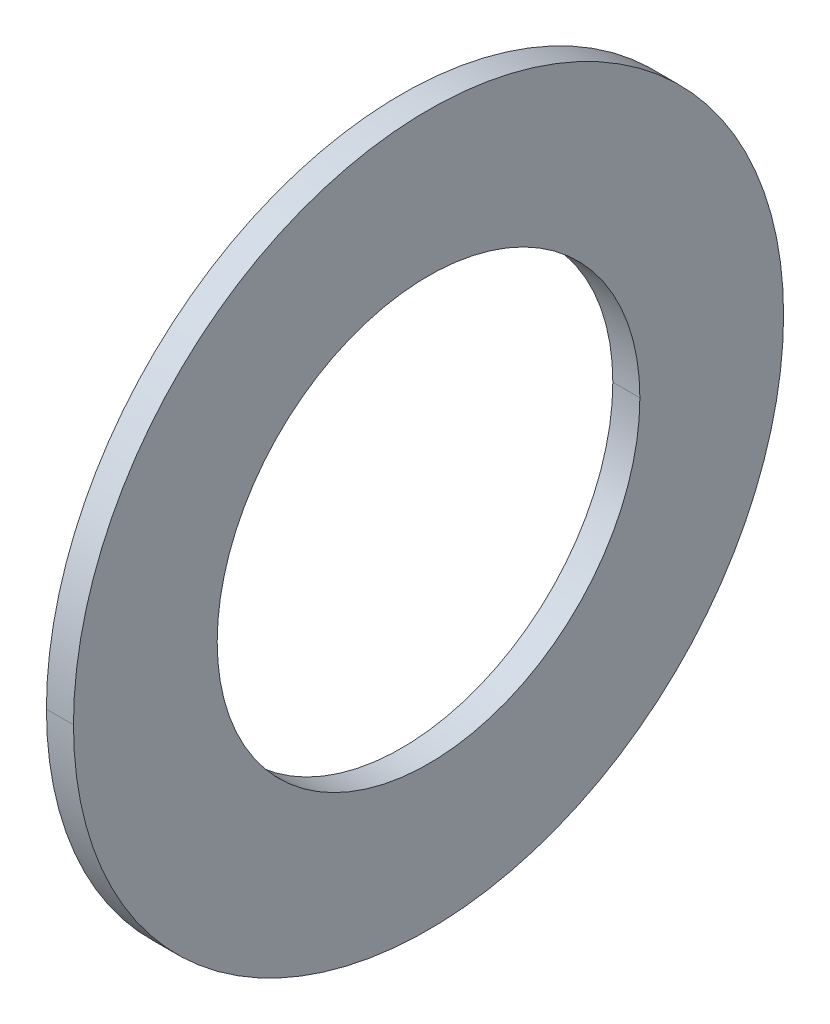
ISO-10303-21;
HEADER;
FILE_DESCRIPTION(('STEP AP214'),'2;1');
FILE_NAME('part.step','',(''),(''),'','','');
FILE_SCHEMA(('AUTOMOTIVE_DESIGN { 1 0 10303 214 1 1 1 1 }'));
ENDSEC;
DATA;
#1=APPLICATION_CONTEXT('core data for automotive mechanical design processes');
#2=APPLICATION_PROTOCOL_DEFINITION('international standard','automotive_design',2000,#1);
#3=PRODUCT_CONTEXT('',#1,'mechanical');
#4=PRODUCT('Part','Part','',(#3));
#5=PRODUCT_RELATED_PRODUCT_CATEGORY('part','',(#4));
#6=PRODUCT_DEFINITION_FORMATION('','',#4);
#7=PRODUCT_DEFINITION_CONTEXT('part definition',#1,'design');
#8=PRODUCT_DEFINITION('design','',#6,#7);
#9=PRODUCT_DEFINITION_SHAPE('','',#8);
#10=(LENGTH_UNIT() NAMED_UNIT(*) SI_UNIT(.MILLI.,.METRE.));
#11=(NAMED_UNIT(*) PLANE_ANGLE_UNIT() SI_UNIT($,.RADIAN.));
#12=(NAMED_UNIT(*) SI_UNIT($,.STERADIAN.) SOLID_ANGLE_UNIT());
#13=UNCERTAINTY_MEASURE_WITH_UNIT(LENGTH_MEASURE(1.E-05),#10,'distance_accuracy_value','');
#14=(GEOMETRIC_REPRESENTATION_CONTEXT(3) GLOBAL_UNCERTAINTY_ASSIGNED_CONTEXT((#13)) GLOBAL_UNIT_ASSIGNED_CONTEXT((#10,
#11,#12)) REPRESENTATION_CONTEXT('',''));
#15=CARTESIAN_POINT('',(0.,0.,0.));
#16=DIRECTION('',(0.,0.,1.));
#17=DIRECTION('',(1.,0.,0.));
#18=AXIS2_PLACEMENT_3D('',#15,#16,#17);
#19=CARTESIAN_POINT('',(0.8,0.,0.));
#20=DIRECTION('',(-1.,0.,0.));
#21=DIRECTION('',(0.,1.,0.));
#22=AXIS2_PLACEMENT_3D('',#19,#20,#21);
#23=CYLINDRICAL_SURFACE('',#22,12.5);
#24=DIRECTION('',(-1.,0.,0.));
#25=VECTOR('',#24,1.);
#26=CARTESIAN_POINT('',(0.8,0.,-12.5));
#27=LINE('',#26,#25);
#28=CARTESIAN_POINT('',(0.8,0.,-12.5));
#29=VERTEX_POINT('',#28);
#30=CARTESIAN_POINT('',(-0.8,0.,-12.5));
#31=VERTEX_POINT('',#30);
#32=EDGE_CURVE('E11',#29,#31,#27,.T.);
#33=ORIENTED_EDGE('',*,*,#32,.T.);
#34=CARTESIAN_POINT('',(-0.8,0.,0.));
#35=DIRECTION('',(1.,0.,0.));
#36=DIRECTION('',(0.,0.,-1.));
#37=AXIS2_PLACEMENT_3D('',#34,#35,#36);
#38=CIRCLE('',#37,12.5);
#39=CARTESIAN_POINT('',(-0.8,0.,12.5));
#40=VERTEX_POINT('',#39);
#41=EDGE_CURVE('E25',#40,#31,#38,.T.);
#42=ORIENTED_EDGE('',*,*,#41,.F.);
#43=DIRECTION('',(-1.,0.,0.));
#44=VECTOR('',#43,1.);
#45=CARTESIAN_POINT('',(0.8,0.,12.5));
#46=LINE('',#45,#44);
#47=CARTESIAN_POINT('',(0.8,0.,12.5));
#48=VERTEX_POINT('',#47);
#49=EDGE_CURVE('E94',#48,#40,#46,.T.);
#50=ORIENTED_EDGE('',*,*,#49,.F.);
#51=CARTESIAN_POINT('',(0.8,0.,0.));
#52=DIRECTION('',(1.,0.,0.));
#53=DIRECTION('',(0.,0.,-1.));
#54=AXIS2_PLACEMENT_3D('',#51,#52,#53);
#55=CIRCLE('',#54,12.5);
#56=EDGE_CURVE('E90',#48,#29,#55,.T.);
#57=ORIENTED_EDGE('',*,*,#56,.T.);
#58=EDGE_LOOP('',(#33,#42,#50,#57));
#59=FACE_BOUND('',#58,.T.);
#60=ADVANCED_FACE('F17',(#59),#23,.F.);
#61=CARTESIAN_POINT('',(0.8,0.,0.));
#62=DIRECTION('',(1.,0.,0.));
#63=DIRECTION('',(0.,0.,-1.));
#64=AXIS2_PLACEMENT_3D('',#61,#62,#63);
#65=PLANE('',#64);
#66=ORIENTED_EDGE('',*,*,#56,.F.);
#67=CARTESIAN_POINT('',(0.8,0.,0.));
#68=DIRECTION('',(1.,0.,0.));
#69=DIRECTION('',(0.,0.,-1.));
#70=AXIS2_PLACEMENT_3D('',#67,#68,#69);
#71=CIRCLE('',#70,12.5);
#72=EDGE_CURVE('E85',#29,#48,#71,.T.);
#73=ORIENTED_EDGE('',*,*,#72,.F.);
#74=EDGE_LOOP('',(#66,#73));
#75=FACE_BOUND('',#74,.T.);
#76=CARTESIAN_POINT('',(0.8,0.,0.));
#77=DIRECTION('',(1.,0.,0.));
#78=DIRECTION('',(0.,0.,-1.));
#79=AXIS2_PLACEMENT_3D('',#76,#77,#78);
#80=CIRCLE('',#79,21.);
#81=CARTESIAN_POINT('',(0.8,0.,-21.));
#82=VERTEX_POINT('',#81);
#83=CARTESIAN_POINT('',(0.8,0.,21.));
#84=VERTEX_POINT('',#83);
#85=EDGE_CURVE('E72',#82,#84,#80,.T.);
#86=ORIENTED_EDGE('',*,*,#85,.T.);
#87=CARTESIAN_POINT('',(0.8,0.,0.));
#88=DIRECTION('',(1.,0.,0.));
#89=DIRECTION('',(0.,0.,-1.));
#90=AXIS2_PLACEMENT_3D('',#87,#88,#89);
#91=CIRCLE('',#90,21.);
#92=EDGE_CURVE('E73',#84,#82,#91,.T.);
#93=ORIENTED_EDGE('',*,*,#92,.T.);
#94=EDGE_LOOP('',(#86,#93));
#95=FACE_BOUND('',#94,.T.);
#96=ADVANCED_FACE('F116',(#75,#95),#65,.T.);
#97=CARTESIAN_POINT('',(0.8,0.,0.));
#98=DIRECTION('',(-1.,0.,0.));
#99=DIRECTION('',(0.,1.,0.));
#100=AXIS2_PLACEMENT_3D('',#97,#98,#99);
#101=CYLINDRICAL_SURFACE('',#100,21.);
#102=DIRECTION('',(-1.,0.,0.));
#103=VECTOR('',#102,1.);
#104=CARTESIAN_POINT('',(0.8,0.,-21.));
#105=LINE('',#104,#103);
#106=CARTESIAN_POINT('',(-0.8,0.,-21.));
#107=VERTEX_POINT('',#106);
#108=EDGE_CURVE('E59',#82,#107,#105,.T.);
#109=ORIENTED_EDGE('',*,*,#108,.F.);
#110=ORIENTED_EDGE('',*,*,#92,.F.);
#111=DIRECTION('',(-1.,0.,0.));
#112=VECTOR('',#111,1.);
#113=CARTESIAN_POINT('',(0.8,0.,21.));
#114=LINE('',#113,#112);
#115=CARTESIAN_POINT('',(-0.8,0.,21.));
#116=VERTEX_POINT('',#115);
#117=EDGE_CURVE('E61',#84,#116,#114,.T.);
#118=ORIENTED_EDGE('',*,*,#117,.T.);
#119=CARTESIAN_POINT('',(-0.8,0.,0.));
#120=DIRECTION('',(1.,0.,0.));
#121=DIRECTION('',(0.,0.,-1.));
#122=AXIS2_PLACEMENT_3D('',#119,#120,#121);
#123=CIRCLE('',#122,21.);
#124=EDGE_CURVE('E54',#116,#107,#123,.T.);
#125=ORIENTED_EDGE('',*,*,#124,.T.);
#126=EDGE_LOOP('',(#109,#110,#118,#125));
#127=FACE_BOUND('',#126,.T.);
#128=ADVANCED_FACE('F56',(#127),#101,.T.);
#129=CARTESIAN_POINT('',(-0.8,0.,0.));
#130=DIRECTION('',(1.,0.,0.));
#131=DIRECTION('',(0.,0.,-1.));
#132=AXIS2_PLACEMENT_3D('',#129,#130,#131);
#133=PLANE('',#132);
#134=CARTESIAN_POINT('',(-0.8,0.,0.));
#135=DIRECTION('',(1.,0.,0.));
#136=DIRECTION('',(0.,0.,-1.));
#137=AXIS2_PLACEMENT_3D('',#134,#135,#136);
#138=CIRCLE('',#137,12.5);
#139=EDGE_CURVE('E64',#31,#40,#138,.T.);
#140=ORIENTED_EDGE('',*,*,#139,.T.);
#141=ORIENTED_EDGE('',*,*,#41,.T.);
#142=EDGE_LOOP('',(#140,#141));
#143=FACE_BOUND('',#142,.T.);
#144=ORIENTED_EDGE('',*,*,#124,.F.);
#145=CARTESIAN_POINT('',(-0.8,0.,0.));
#146=DIRECTION('',(1.,0.,0.));
#147=DIRECTION('',(0.,0.,-1.));
#148=AXIS2_PLACEMENT_3D('',#145,#146,#147);
#149=CIRCLE('',#148,21.);
#150=EDGE_CURVE('E66',#107,#116,#149,.T.);
#151=ORIENTED_EDGE('',*,*,#150,.F.);
#152=EDGE_LOOP('',(#144,#151));
#153=FACE_BOUND('',#152,.T.);
#154=ADVANCED_FACE('F67',(#143,#153),#133,.F.);
#155=CARTESIAN_POINT('',(0.8,0.,0.));
#156=DIRECTION('',(-1.,0.,0.));
#157=DIRECTION('',(0.,-1.,0.));
#158=AXIS2_PLACEMENT_3D('',#155,#156,#157);
#159=CYLINDRICAL_SURFACE('',#158,21.);
#160=ORIENTED_EDGE('',*,*,#108,.T.);
#161=ORIENTED_EDGE('',*,*,#150,.T.);
#162=ORIENTED_EDGE('',*,*,#117,.F.);
#163=ORIENTED_EDGE('',*,*,#85,.F.);
#164=EDGE_LOOP('',(#160,#161,#162,#163));
#165=FACE_BOUND('',#164,.T.);
#166=ADVANCED_FACE('F71',(#165),#159,.T.);
#167=CARTESIAN_POINT('',(0.8,0.,0.));
#168=DIRECTION('',(-1.,0.,0.));
#169=DIRECTION('',(0.,-1.,0.));
#170=AXIS2_PLACEMENT_3D('',#167,#168,#169);
#171=CYLINDRICAL_SURFACE('',#170,12.5);
#172=ORIENTED_EDGE('',*,*,#32,.F.);
#173=ORIENTED_EDGE('',*,*,#72,.T.);
#174=ORIENTED_EDGE('',*,*,#49,.T.);
#175=ORIENTED_EDGE('',*,*,#139,.F.);
#176=EDGE_LOOP('',(#172,#173,#174,#175));
#177=FACE_BOUND('',#176,.T.);
#178=ADVANCED_FACE('F112',(#177),#171,.F.);
#179=CLOSED_SHELL('',(#60,#96,#128,#154,#166,#178));
#180=MANIFOLD_SOLID_BREP('B1',#179);
#181=ADVANCED_BREP_SHAPE_REPRESENTATION('',(#18,#180),#14);
#182=SHAPE_DEFINITION_REPRESENTATION(#9,#181);
ENDSEC;
END-ISO-10303-21;
